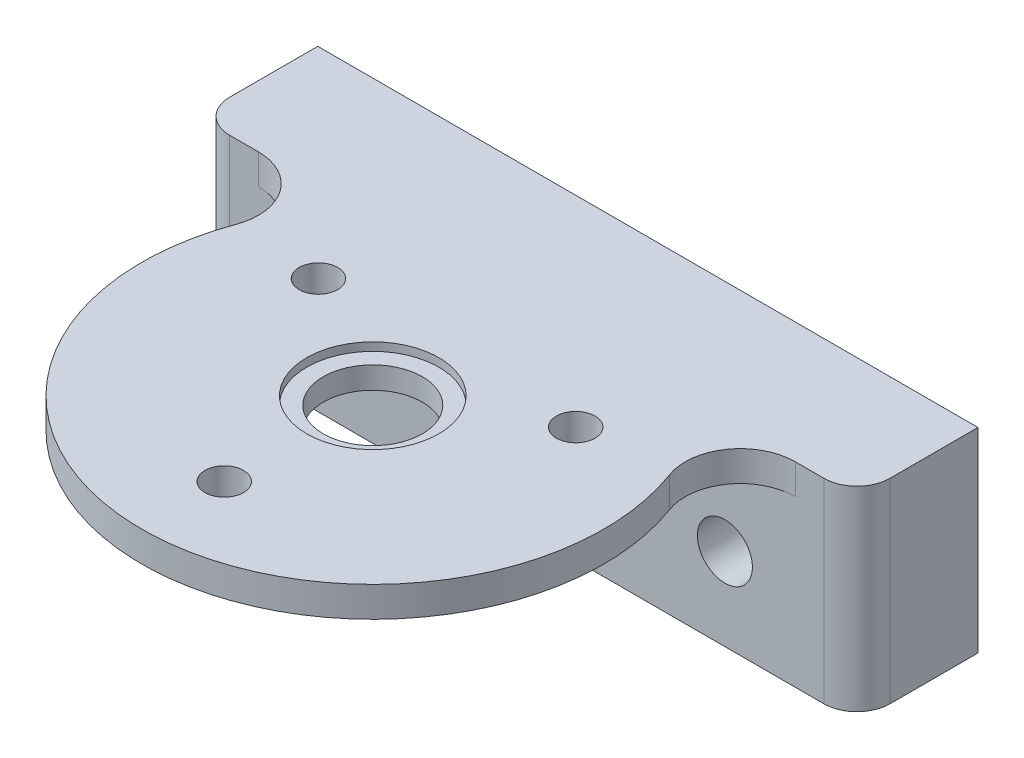
ISO-10303-21;
HEADER;
FILE_DESCRIPTION(('STEP AP214'),'2;1');
FILE_NAME('part.step','',(''),(''),'','','');
FILE_SCHEMA(('AUTOMOTIVE_DESIGN { 1 0 10303 214 1 1 1 1 }'));
ENDSEC;
DATA;
#1=APPLICATION_CONTEXT('core data for automotive mechanical design processes');
#2=APPLICATION_PROTOCOL_DEFINITION('international standard','automotive_design',2000,#1);
#3=PRODUCT_CONTEXT('',#1,'mechanical');
#4=PRODUCT('Part','Part','',(#3));
#5=PRODUCT_RELATED_PRODUCT_CATEGORY('part','',(#4));
#6=PRODUCT_DEFINITION_FORMATION('','',#4);
#7=PRODUCT_DEFINITION_CONTEXT('part definition',#1,'design');
#8=PRODUCT_DEFINITION('design','',#6,#7);
#9=PRODUCT_DEFINITION_SHAPE('','',#8);
#10=(LENGTH_UNIT() NAMED_UNIT(*) SI_UNIT(.MILLI.,.METRE.));
#11=(NAMED_UNIT(*) PLANE_ANGLE_UNIT() SI_UNIT($,.RADIAN.));
#12=(NAMED_UNIT(*) SI_UNIT($,.STERADIAN.) SOLID_ANGLE_UNIT());
#13=UNCERTAINTY_MEASURE_WITH_UNIT(LENGTH_MEASURE(1.E-05),#10,'distance_accuracy_value','');
#14=(GEOMETRIC_REPRESENTATION_CONTEXT(3) GLOBAL_UNCERTAINTY_ASSIGNED_CONTEXT((#13)) GLOBAL_UNIT_ASSIGNED_CONTEXT((#10,
#11,#12)) REPRESENTATION_CONTEXT('',''));
#15=CARTESIAN_POINT('',(0.,0.,0.));
#16=DIRECTION('',(0.,0.,1.));
#17=DIRECTION('',(1.,0.,0.));
#18=AXIS2_PLACEMENT_3D('',#15,#16,#17);
#19=CARTESIAN_POINT('',(0.,2.,0.));
#20=DIRECTION('',(0.,-1.,0.));
#21=DIRECTION('',(0.,0.,-1.));
#22=AXIS2_PLACEMENT_3D('',#19,#20,#21);
#23=CYLINDRICAL_SURFACE('',#22,4.5);
#24=CARTESIAN_POINT('',(0.,2.,0.));
#25=DIRECTION('',(0.,1.,0.));
#26=DIRECTION('',(0.,0.,1.));
#27=AXIS2_PLACEMENT_3D('',#24,#25,#26);
#28=CIRCLE('',#27,4.5);
#29=CARTESIAN_POINT('',(0.,2.,4.5));
#30=VERTEX_POINT('',#29);
#31=EDGE_CURVE('E180',#30,#30,#28,.T.);
#32=ORIENTED_EDGE('',*,*,#31,.T.);
#33=EDGE_LOOP('',(#32));
#34=FACE_BOUND('',#33,.T.);
#35=CARTESIAN_POINT('',(0.,0.,0.));
#36=DIRECTION('',(0.,1.,0.));
#37=DIRECTION('',(0.,0.,1.));
#38=AXIS2_PLACEMENT_3D('',#35,#36,#37);
#39=CIRCLE('',#38,4.5);
#40=CARTESIAN_POINT('',(0.,0.,4.5));
#41=VERTEX_POINT('',#40);
#42=EDGE_CURVE('E179',#41,#41,#39,.T.);
#43=ORIENTED_EDGE('',*,*,#42,.F.);
#44=EDGE_LOOP('',(#43));
#45=FACE_BOUND('',#44,.T.);
#46=ADVANCED_FACE('F36',(#34,#45),#23,.F.);
#47=CARTESIAN_POINT('',(0.,2.,0.));
#48=DIRECTION('',(0.,1.,0.));
#49=DIRECTION('',(0.,0.,1.));
#50=AXIS2_PLACEMENT_3D('',#47,#48,#49);
#51=PLANE('',#50);
#52=ORIENTED_EDGE('',*,*,#31,.F.);
#53=EDGE_LOOP('',(#52));
#54=FACE_BOUND('',#53,.T.);
#55=CARTESIAN_POINT('',(0.,2.,0.));
#56=DIRECTION('',(0.,1.,0.));
#57=DIRECTION('',(0.,0.,1.));
#58=AXIS2_PLACEMENT_3D('',#55,#56,#57);
#59=CIRCLE('',#58,6.);
#60=CARTESIAN_POINT('',(0.,2.,6.));
#61=VERTEX_POINT('',#60);
#62=EDGE_CURVE('E174',#61,#61,#59,.F.);
#63=ORIENTED_EDGE('',*,*,#62,.F.);
#64=EDGE_LOOP('',(#63));
#65=FACE_BOUND('',#64,.T.);
#66=ADVANCED_FACE('F272',(#54,#65),#51,.T.);
#67=CARTESIAN_POINT('',(0.,0.,0.));
#68=DIRECTION('',(0.,1.,0.));
#69=DIRECTION('',(0.,0.,1.));
#70=AXIS2_PLACEMENT_3D('',#67,#68,#69);
#71=PLANE('',#70);
#72=CARTESIAN_POINT('',(-11.6913429510899,0.,-6.75000000000005));
#73=DIRECTION('',(0.,1.,0.));
#74=DIRECTION('',(0.,0.,1.));
#75=AXIS2_PLACEMENT_3D('',#72,#73,#74);
#76=CIRCLE('',#75,1.75);
#77=CARTESIAN_POINT('',(-11.6913429510899,0.,-5.00000000000005));
#78=VERTEX_POINT('',#77);
#79=EDGE_CURVE('E158',#78,#78,#76,.T.);
#80=ORIENTED_EDGE('',*,*,#79,.T.);
#81=EDGE_LOOP('',(#80));
#82=FACE_BOUND('',#81,.T.);
#83=CARTESIAN_POINT('',(11.69134295109,0.,-6.74999999999989));
#84=DIRECTION('',(0.,1.,0.));
#85=DIRECTION('',(0.,0.,1.));
#86=AXIS2_PLACEMENT_3D('',#83,#84,#85);
#87=CIRCLE('',#86,1.75);
#88=CARTESIAN_POINT('',(11.69134295109,0.,-4.99999999999989));
#89=VERTEX_POINT('',#88);
#90=EDGE_CURVE('E153',#89,#89,#87,.T.);
#91=ORIENTED_EDGE('',*,*,#90,.T.);
#92=EDGE_LOOP('',(#91));
#93=FACE_BOUND('',#92,.T.);
#94=CARTESIAN_POINT('',(0.,0.,13.5));
#95=DIRECTION('',(0.,1.,0.));
#96=DIRECTION('',(0.,0.,1.));
#97=AXIS2_PLACEMENT_3D('',#94,#95,#96);
#98=CIRCLE('',#97,1.75);
#99=CARTESIAN_POINT('',(0.,0.,15.25));
#100=VERTEX_POINT('',#99);
#101=EDGE_CURVE('E164',#100,#100,#98,.T.);
#102=ORIENTED_EDGE('',*,*,#101,.T.);
#103=EDGE_LOOP('',(#102));
#104=FACE_BOUND('',#103,.T.);
#105=ORIENTED_EDGE('',*,*,#42,.T.);
#106=EDGE_LOOP('',(#105));
#107=FACE_BOUND('',#106,.T.);
#108=CARTESIAN_POINT('',(0.,0.,0.));
#109=DIRECTION('',(0.,1.,0.));
#110=DIRECTION('',(0.,0.,1.));
#111=AXIS2_PLACEMENT_3D('',#108,#109,#110);
#112=CIRCLE('',#111,21.);
#113=CARTESIAN_POINT('',(-19.70173302082,0.,-7.26923076923077));
#114=VERTEX_POINT('',#113);
#115=CARTESIAN_POINT('',(19.70173302082,0.,-7.26923076923077));
#116=VERTEX_POINT('',#115);
#117=EDGE_CURVE('E168',#114,#116,#112,.T.);
#118=ORIENTED_EDGE('',*,*,#117,.F.);
#119=CARTESIAN_POINT('',(-24.3926218353009,0.,-9.));
#120=DIRECTION('',(0.,1.,0.));
#121=DIRECTION('',(0.,0.,1.));
#122=AXIS2_PLACEMENT_3D('',#119,#120,#121);
#123=CIRCLE('',#122,5.);
#124=CARTESIAN_POINT('',(-24.3926218353009,0.,-14.));
#125=VERTEX_POINT('',#124);
#126=EDGE_CURVE('E44',#114,#125,#123,.T.);
#127=ORIENTED_EDGE('',*,*,#126,.T.);
#128=DIRECTION('',(1.,0.,0.));
#129=VECTOR('',#128,1.);
#130=CARTESIAN_POINT('',(0.,0.,-14.));
#131=LINE('',#130,#129);
#132=CARTESIAN_POINT('',(24.3926218353009,0.,-14.));
#133=VERTEX_POINT('',#132);
#134=EDGE_CURVE('E51',#125,#133,#131,.T.);
#135=ORIENTED_EDGE('',*,*,#134,.T.);
#136=CARTESIAN_POINT('',(24.3926218353009,0.,-8.99999999999999));
#137=DIRECTION('',(0.,1.,0.));
#138=DIRECTION('',(0.,0.,1.));
#139=AXIS2_PLACEMENT_3D('',#136,#137,#138);
#140=CIRCLE('',#139,5.);
#141=EDGE_CURVE('E215',#133,#116,#140,.T.);
#142=ORIENTED_EDGE('',*,*,#141,.T.);
#143=EDGE_LOOP('',(#118,#127,#135,#142));
#144=FACE_BOUND('',#143,.T.);
#145=ADVANCED_FACE('F218',(#82,#93,#104,#107,#144),#71,.F.);
#146=CARTESIAN_POINT('',(0.,62.89696961967,0.));
#147=DIRECTION('',(0.,-1.,0.));
#148=DIRECTION('',(0.,0.,-1.));
#149=AXIS2_PLACEMENT_3D('',#146,#147,#148);
#150=CYLINDRICAL_SURFACE('',#149,6.);
#151=ORIENTED_EDGE('',*,*,#62,.T.);
#152=EDGE_LOOP('',(#151));
#153=FACE_BOUND('',#152,.T.);
#154=CARTESIAN_POINT('',(0.,2.75,0.));
#155=DIRECTION('',(0.,1.,0.));
#156=DIRECTION('',(0.,0.,1.));
#157=AXIS2_PLACEMENT_3D('',#154,#155,#156);
#158=CIRCLE('',#157,6.);
#159=CARTESIAN_POINT('',(0.,2.75,6.));
#160=VERTEX_POINT('',#159);
#161=EDGE_CURVE('E167',#160,#160,#158,.T.);
#162=ORIENTED_EDGE('',*,*,#161,.T.);
#163=EDGE_LOOP('',(#162));
#164=FACE_BOUND('',#163,.T.);
#165=ADVANCED_FACE('F324',(#153,#164),#150,.F.);
#166=CARTESIAN_POINT('',(0.,62.89696961967,0.));
#167=DIRECTION('',(0.,-1.,0.));
#168=DIRECTION('',(0.,0.,-1.));
#169=AXIS2_PLACEMENT_3D('',#166,#167,#168);
#170=CYLINDRICAL_SURFACE('',#169,21.);
#171=ORIENTED_EDGE('',*,*,#117,.T.);
#172=DIRECTION('',(0.,-1.,0.));
#173=VECTOR('',#172,1.);
#174=CARTESIAN_POINT('',(19.70173302082,62.89696961967,-7.26923076923077));
#175=LINE('',#174,#173);
#176=CARTESIAN_POINT('',(19.70173302082,2.75,-7.26923076923077));
#177=VERTEX_POINT('',#176);
#178=EDGE_CURVE('E206',#116,#177,#175,.F.);
#179=ORIENTED_EDGE('',*,*,#178,.T.);
#180=CARTESIAN_POINT('',(0.,2.75,0.));
#181=DIRECTION('',(0.,1.,0.));
#182=DIRECTION('',(0.,0.,1.));
#183=AXIS2_PLACEMENT_3D('',#180,#181,#182);
#184=CIRCLE('',#183,21.);
#185=CARTESIAN_POINT('',(-19.70173302082,2.75,-7.26923076923077));
#186=VERTEX_POINT('',#185);
#187=EDGE_CURVE('E171',#186,#177,#184,.T.);
#188=ORIENTED_EDGE('',*,*,#187,.F.);
#189=DIRECTION('',(0.,-1.,0.));
#190=VECTOR('',#189,1.);
#191=CARTESIAN_POINT('',(-19.70173302082,62.89696961967,-7.26923076923077));
#192=LINE('',#191,#190);
#193=EDGE_CURVE('E203',#186,#114,#192,.T.);
#194=ORIENTED_EDGE('',*,*,#193,.T.);
#195=EDGE_LOOP('',(#171,#179,#188,#194));
#196=FACE_BOUND('',#195,.T.);
#197=ADVANCED_FACE('F298',(#196),#170,.T.);
#198=CARTESIAN_POINT('',(0.,2.75,0.));
#199=DIRECTION('',(0.,1.,0.));
#200=DIRECTION('',(0.,0.,1.));
#201=AXIS2_PLACEMENT_3D('',#198,#199,#200);
#202=PLANE('',#201);
#203=DIRECTION('',(0.,0.,-1.));
#204=VECTOR('',#203,1.);
#205=CARTESIAN_POINT('',(-30.,2.75,-25.));
#206=LINE('',#205,#204);
#207=CARTESIAN_POINT('',(-30.,2.75,-17.));
#208=VERTEX_POINT('',#207);
#209=CARTESIAN_POINT('',(-30.,2.75,-25.));
#210=VERTEX_POINT('',#209);
#211=EDGE_CURVE('E126',#208,#210,#206,.T.);
#212=ORIENTED_EDGE('',*,*,#211,.F.);
#213=CARTESIAN_POINT('',(-27.,2.75,-17.));
#214=DIRECTION('',(0.,1.,0.));
#215=DIRECTION('',(0.,0.,1.));
#216=AXIS2_PLACEMENT_3D('',#213,#214,#215);
#217=CIRCLE('',#216,3.);
#218=CARTESIAN_POINT('',(-27.,2.75,-14.));
#219=VERTEX_POINT('',#218);
#220=EDGE_CURVE('E197',#208,#219,#217,.T.);
#221=ORIENTED_EDGE('',*,*,#220,.T.);
#222=DIRECTION('',(-1.,0.,0.));
#223=VECTOR('',#222,1.);
#224=CARTESIAN_POINT('',(-30.,2.75,-14.));
#225=LINE('',#224,#223);
#226=CARTESIAN_POINT('',(-24.3926218353009,2.75,-14.));
#227=VERTEX_POINT('',#226);
#228=EDGE_CURVE('E135',#227,#219,#225,.T.);
#229=ORIENTED_EDGE('',*,*,#228,.F.);
#230=CARTESIAN_POINT('',(-24.3926218353009,2.75,-9.));
#231=DIRECTION('',(0.,1.,0.));
#232=DIRECTION('',(0.,0.,1.));
#233=AXIS2_PLACEMENT_3D('',#230,#231,#232);
#234=CIRCLE('',#233,5.);
#235=EDGE_CURVE('E12',#227,#186,#234,.F.);
#236=ORIENTED_EDGE('',*,*,#235,.T.);
#237=ORIENTED_EDGE('',*,*,#187,.T.);
#238=CARTESIAN_POINT('',(24.3926218353009,2.75,-8.99999999999999));
#239=DIRECTION('',(0.,1.,0.));
#240=DIRECTION('',(0.,0.,1.));
#241=AXIS2_PLACEMENT_3D('',#238,#239,#240);
#242=CIRCLE('',#241,5.);
#243=CARTESIAN_POINT('',(24.3926218353009,2.75,-14.));
#244=VERTEX_POINT('',#243);
#245=EDGE_CURVE('E213',#177,#244,#242,.F.);
#246=ORIENTED_EDGE('',*,*,#245,.T.);
#247=CARTESIAN_POINT('',(27.,2.75,-14.));
#248=VERTEX_POINT('',#247);
#249=EDGE_CURVE('E137',#248,#244,#225,.T.);
#250=ORIENTED_EDGE('',*,*,#249,.F.);
#251=CARTESIAN_POINT('',(27.,2.75,-17.));
#252=DIRECTION('',(0.,1.,0.));
#253=DIRECTION('',(0.,0.,1.));
#254=AXIS2_PLACEMENT_3D('',#251,#252,#253);
#255=CIRCLE('',#254,3.);
#256=CARTESIAN_POINT('',(30.,2.75,-17.));
#257=VERTEX_POINT('',#256);
#258=EDGE_CURVE('E195',#248,#257,#255,.T.);
#259=ORIENTED_EDGE('',*,*,#258,.T.);
#260=DIRECTION('',(0.,0.,1.));
#261=VECTOR('',#260,1.);
#262=CARTESIAN_POINT('',(30.,2.75,-25.));
#263=LINE('',#262,#261);
#264=CARTESIAN_POINT('',(30.,2.75,-25.));
#265=VERTEX_POINT('',#264);
#266=EDGE_CURVE('E142',#265,#257,#263,.T.);
#267=ORIENTED_EDGE('',*,*,#266,.F.);
#268=DIRECTION('',(1.,0.,0.));
#269=VECTOR('',#268,1.);
#270=CARTESIAN_POINT('',(-30.,2.75,-25.));
#271=LINE('',#270,#269);
#272=EDGE_CURVE('E130',#210,#265,#271,.T.);
#273=ORIENTED_EDGE('',*,*,#272,.F.);
#274=EDGE_LOOP('',(#212,#221,#229,#236,#237,#246,#250,#259,#267,#273));
#275=FACE_BOUND('',#274,.T.);
#276=CARTESIAN_POINT('',(-11.6913429510899,2.75,-6.75000000000005));
#277=DIRECTION('',(0.,1.,0.));
#278=DIRECTION('',(-0.866025403784436,0.,-0.500000000000004));
#279=AXIS2_PLACEMENT_3D('',#276,#277,#278);
#280=CIRCLE('',#279,1.75);
#281=CARTESIAN_POINT('',(-13.2068874077127,2.75,-7.62500000000006));
#282=VERTEX_POINT('',#281);
#283=EDGE_CURVE('E150',#282,#282,#280,.T.);
#284=ORIENTED_EDGE('',*,*,#283,.F.);
#285=EDGE_LOOP('',(#284));
#286=FACE_BOUND('',#285,.T.);
#287=CARTESIAN_POINT('',(11.69134295109,2.75,-6.74999999999989));
#288=DIRECTION('',(0.,1.,0.));
#289=DIRECTION('',(0.866025403784443,0.,-0.499999999999992));
#290=AXIS2_PLACEMENT_3D('',#287,#288,#289);
#291=CIRCLE('',#290,1.75);
#292=CARTESIAN_POINT('',(13.2068874077128,2.75,-7.62499999999988));
#293=VERTEX_POINT('',#292);
#294=EDGE_CURVE('E149',#293,#293,#291,.T.);
#295=ORIENTED_EDGE('',*,*,#294,.F.);
#296=EDGE_LOOP('',(#295));
#297=FACE_BOUND('',#296,.T.);
#298=CARTESIAN_POINT('',(0.,2.75,13.5));
#299=DIRECTION('',(0.,1.,0.));
#300=DIRECTION('',(0.,0.,1.));
#301=AXIS2_PLACEMENT_3D('',#298,#299,#300);
#302=CIRCLE('',#301,1.75);
#303=CARTESIAN_POINT('',(0.,2.75,15.25));
#304=VERTEX_POINT('',#303);
#305=EDGE_CURVE('E161',#304,#304,#302,.T.);
#306=ORIENTED_EDGE('',*,*,#305,.F.);
#307=EDGE_LOOP('',(#306));
#308=FACE_BOUND('',#307,.T.);
#309=ORIENTED_EDGE('',*,*,#161,.F.);
#310=EDGE_LOOP('',(#309));
#311=FACE_BOUND('',#310,.T.);
#312=ADVANCED_FACE('F225',(#275,#286,#297,#308,#311),#202,.T.);
#313=CARTESIAN_POINT('',(0.,-1.75,13.5));
#314=DIRECTION('',(0.,1.,0.));
#315=DIRECTION('',(0.,0.,1.));
#316=AXIS2_PLACEMENT_3D('',#313,#314,#315);
#317=CYLINDRICAL_SURFACE('',#316,1.75);
#318=ORIENTED_EDGE('',*,*,#305,.T.);
#319=EDGE_LOOP('',(#318));
#320=FACE_BOUND('',#319,.T.);
#321=ORIENTED_EDGE('',*,*,#101,.F.);
#322=EDGE_LOOP('',(#321));
#323=FACE_BOUND('',#322,.T.);
#324=ADVANCED_FACE('F319',(#320,#323),#317,.F.);
#325=CARTESIAN_POINT('',(11.69134295109,-1.75,-6.74999999999989));
#326=DIRECTION('',(0.,1.,0.));
#327=DIRECTION('',(0.,0.,1.));
#328=AXIS2_PLACEMENT_3D('',#325,#326,#327);
#329=CYLINDRICAL_SURFACE('',#328,1.75);
#330=ORIENTED_EDGE('',*,*,#294,.T.);
#331=EDGE_LOOP('',(#330));
#332=FACE_BOUND('',#331,.T.);
#333=ORIENTED_EDGE('',*,*,#90,.F.);
#334=EDGE_LOOP('',(#333));
#335=FACE_BOUND('',#334,.T.);
#336=ADVANCED_FACE('F315',(#332,#335),#329,.F.);
#337=CARTESIAN_POINT('',(-11.6913429510899,-1.75,-6.75000000000005));
#338=DIRECTION('',(0.,1.,0.));
#339=DIRECTION('',(0.,0.,1.));
#340=AXIS2_PLACEMENT_3D('',#337,#338,#339);
#341=CYLINDRICAL_SURFACE('',#340,1.75);
#342=ORIENTED_EDGE('',*,*,#283,.T.);
#343=EDGE_LOOP('',(#342));
#344=FACE_BOUND('',#343,.T.);
#345=ORIENTED_EDGE('',*,*,#79,.F.);
#346=EDGE_LOOP('',(#345));
#347=FACE_BOUND('',#346,.T.);
#348=ADVANCED_FACE('F254',(#344,#347),#341,.F.);
#349=CARTESIAN_POINT('',(-30.,63.75,-14.));
#350=DIRECTION('',(0.,0.,1.));
#351=DIRECTION('',(1.,0.,0.));
#352=AXIS2_PLACEMENT_3D('',#349,#350,#351);
#353=PLANE('',#352);
#354=CARTESIAN_POINT('',(-18.,-7.5,-14.));
#355=DIRECTION('',(0.,0.,1.));
#356=DIRECTION('',(1.,0.,0.));
#357=AXIS2_PLACEMENT_3D('',#354,#355,#356);
#358=CIRCLE('',#357,2.5);
#359=CARTESIAN_POINT('',(-15.5,-7.5,-14.));
#360=VERTEX_POINT('',#359);
#361=EDGE_CURVE('E235',#360,#360,#358,.T.);
#362=ORIENTED_EDGE('',*,*,#361,.F.);
#363=EDGE_LOOP('',(#362));
#364=FACE_BOUND('',#363,.T.);
#365=CARTESIAN_POINT('',(18.,-7.49999999999999,-14.));
#366=DIRECTION('',(0.,0.,1.));
#367=DIRECTION('',(-1.,0.,0.));
#368=AXIS2_PLACEMENT_3D('',#365,#366,#367);
#369=CIRCLE('',#368,2.5);
#370=CARTESIAN_POINT('',(15.5,-7.49999999999999,-14.));
#371=VERTEX_POINT('',#370);
#372=EDGE_CURVE('E241',#371,#371,#369,.T.);
#373=ORIENTED_EDGE('',*,*,#372,.F.);
#374=EDGE_LOOP('',(#373));
#375=FACE_BOUND('',#374,.T.);
#376=ORIENTED_EDGE('',*,*,#249,.T.);
#377=DIRECTION('',(0.,-1.,0.));
#378=VECTOR('',#377,1.);
#379=CARTESIAN_POINT('',(24.3926218353009,63.75,-14.));
#380=LINE('',#379,#378);
#381=EDGE_CURVE('E211',#244,#133,#380,.T.);
#382=ORIENTED_EDGE('',*,*,#381,.T.);
#383=ORIENTED_EDGE('',*,*,#134,.F.);
#384=DIRECTION('',(0.,-1.,0.));
#385=VECTOR('',#384,1.);
#386=CARTESIAN_POINT('',(-24.3926218353009,63.75,-14.));
#387=LINE('',#386,#385);
#388=EDGE_CURVE('E209',#125,#227,#387,.F.);
#389=ORIENTED_EDGE('',*,*,#388,.T.);
#390=ORIENTED_EDGE('',*,*,#228,.T.);
#391=DIRECTION('',(0.,-1.,0.));
#392=VECTOR('',#391,1.);
#393=CARTESIAN_POINT('',(-27.,63.75,-14.));
#394=LINE('',#393,#392);
#395=CARTESIAN_POINT('',(-27.,-15.,-14.));
#396=VERTEX_POINT('',#395);
#397=EDGE_CURVE('E187',#219,#396,#394,.T.);
#398=ORIENTED_EDGE('',*,*,#397,.T.);
#399=DIRECTION('',(-1.,0.,0.));
#400=VECTOR('',#399,1.);
#401=CARTESIAN_POINT('',(-30.,-15.,-14.));
#402=LINE('',#401,#400);
#403=CARTESIAN_POINT('',(27.,-15.,-14.));
#404=VERTEX_POINT('',#403);
#405=EDGE_CURVE('E120',#404,#396,#402,.T.);
#406=ORIENTED_EDGE('',*,*,#405,.F.);
#407=DIRECTION('',(0.,-1.,0.));
#408=VECTOR('',#407,1.);
#409=CARTESIAN_POINT('',(27.,63.75,-14.));
#410=LINE('',#409,#408);
#411=EDGE_CURVE('E183',#404,#248,#410,.F.);
#412=ORIENTED_EDGE('',*,*,#411,.T.);
#413=EDGE_LOOP('',(#376,#382,#383,#389,#390,#398,#406,#412));
#414=FACE_BOUND('',#413,.T.);
#415=ADVANCED_FACE('F223',(#364,#375,#414),#353,.T.);
#416=CARTESIAN_POINT('',(-30.,63.75,-25.));
#417=DIRECTION('',(-1.,0.,0.));
#418=DIRECTION('',(0.,0.,1.));
#419=AXIS2_PLACEMENT_3D('',#416,#417,#418);
#420=PLANE('',#419);
#421=DIRECTION('',(0.,0.,-1.));
#422=VECTOR('',#421,1.);
#423=CARTESIAN_POINT('',(-30.,-15.,-25.));
#424=LINE('',#423,#422);
#425=CARTESIAN_POINT('',(-30.,-15.,-17.));
#426=VERTEX_POINT('',#425);
#427=CARTESIAN_POINT('',(-30.,-15.,-25.));
#428=VERTEX_POINT('',#427);
#429=EDGE_CURVE('E109',#426,#428,#424,.T.);
#430=ORIENTED_EDGE('',*,*,#429,.F.);
#431=DIRECTION('',(0.,-1.,0.));
#432=VECTOR('',#431,1.);
#433=CARTESIAN_POINT('',(-30.,63.75,-17.));
#434=LINE('',#433,#432);
#435=EDGE_CURVE('E193',#426,#208,#434,.F.);
#436=ORIENTED_EDGE('',*,*,#435,.T.);
#437=ORIENTED_EDGE('',*,*,#211,.T.);
#438=DIRECTION('',(0.,-1.,0.));
#439=VECTOR('',#438,1.);
#440=CARTESIAN_POINT('',(-30.,63.75,-25.));
#441=LINE('',#440,#439);
#442=EDGE_CURVE('E123',#210,#428,#441,.T.);
#443=ORIENTED_EDGE('',*,*,#442,.T.);
#444=EDGE_LOOP('',(#430,#436,#437,#443));
#445=FACE_BOUND('',#444,.T.);
#446=ADVANCED_FACE('F124',(#445),#420,.T.);
#447=CARTESIAN_POINT('',(-30.,63.75,-25.));
#448=DIRECTION('',(0.,0.,-1.));
#449=DIRECTION('',(-1.,0.,0.));
#450=AXIS2_PLACEMENT_3D('',#447,#448,#449);
#451=PLANE('',#450);
#452=CARTESIAN_POINT('',(-18.,-7.5,-25.));
#453=DIRECTION('',(0.,0.,-1.));
#454=DIRECTION('',(-1.,0.,0.));
#455=AXIS2_PLACEMENT_3D('',#452,#453,#454);
#456=CIRCLE('',#455,2.5);
#457=CARTESIAN_POINT('',(-20.5,-7.5,-25.));
#458=VERTEX_POINT('',#457);
#459=EDGE_CURVE('E244',#458,#458,#456,.F.);
#460=ORIENTED_EDGE('',*,*,#459,.T.);
#461=EDGE_LOOP('',(#460));
#462=FACE_BOUND('',#461,.T.);
#463=CARTESIAN_POINT('',(18.,-7.49999999999999,-25.));
#464=DIRECTION('',(0.,0.,-1.));
#465=DIRECTION('',(-1.,0.,0.));
#466=AXIS2_PLACEMENT_3D('',#463,#464,#465);
#467=CIRCLE('',#466,2.5);
#468=CARTESIAN_POINT('',(15.5,-7.49999999999999,-25.));
#469=VERTEX_POINT('',#468);
#470=EDGE_CURVE('E238',#469,#469,#467,.F.);
#471=ORIENTED_EDGE('',*,*,#470,.T.);
#472=EDGE_LOOP('',(#471));
#473=FACE_BOUND('',#472,.T.);
#474=ORIENTED_EDGE('',*,*,#442,.F.);
#475=ORIENTED_EDGE('',*,*,#272,.T.);
#476=DIRECTION('',(0.,-1.,0.));
#477=VECTOR('',#476,1.);
#478=CARTESIAN_POINT('',(30.,63.75,-25.));
#479=LINE('',#478,#477);
#480=CARTESIAN_POINT('',(30.,-15.,-25.));
#481=VERTEX_POINT('',#480);
#482=EDGE_CURVE('E134',#265,#481,#479,.T.);
#483=ORIENTED_EDGE('',*,*,#482,.T.);
#484=DIRECTION('',(1.,0.,0.));
#485=VECTOR('',#484,1.);
#486=CARTESIAN_POINT('',(-30.,-15.,-25.));
#487=LINE('',#486,#485);
#488=EDGE_CURVE('E115',#428,#481,#487,.T.);
#489=ORIENTED_EDGE('',*,*,#488,.F.);
#490=EDGE_LOOP('',(#474,#475,#483,#489));
#491=FACE_BOUND('',#490,.T.);
#492=ADVANCED_FACE('F132',(#462,#473,#491),#451,.T.);
#493=CARTESIAN_POINT('',(30.,63.75,-25.));
#494=DIRECTION('',(1.,0.,0.));
#495=DIRECTION('',(0.,0.,-1.));
#496=AXIS2_PLACEMENT_3D('',#493,#494,#495);
#497=PLANE('',#496);
#498=ORIENTED_EDGE('',*,*,#266,.T.);
#499=DIRECTION('',(0.,-1.,0.));
#500=VECTOR('',#499,1.);
#501=CARTESIAN_POINT('',(30.,63.75,-17.));
#502=LINE('',#501,#500);
#503=CARTESIAN_POINT('',(30.,-15.,-17.));
#504=VERTEX_POINT('',#503);
#505=EDGE_CURVE('E200',#257,#504,#502,.T.);
#506=ORIENTED_EDGE('',*,*,#505,.T.);
#507=DIRECTION('',(0.,0.,1.));
#508=VECTOR('',#507,1.);
#509=CARTESIAN_POINT('',(30.,-15.,-25.));
#510=LINE('',#509,#508);
#511=EDGE_CURVE('E234',#481,#504,#510,.T.);
#512=ORIENTED_EDGE('',*,*,#511,.F.);
#513=ORIENTED_EDGE('',*,*,#482,.F.);
#514=EDGE_LOOP('',(#498,#506,#512,#513));
#515=FACE_BOUND('',#514,.T.);
#516=ADVANCED_FACE('F268',(#515),#497,.T.);
#517=CARTESIAN_POINT('',(0.,-15.,0.));
#518=DIRECTION('',(0.,1.,0.));
#519=DIRECTION('',(0.,0.,1.));
#520=AXIS2_PLACEMENT_3D('',#517,#518,#519);
#521=PLANE('',#520);
#522=ORIENTED_EDGE('',*,*,#405,.T.);
#523=CARTESIAN_POINT('',(-27.,-15.,-17.));
#524=DIRECTION('',(0.,1.,0.));
#525=DIRECTION('',(0.,0.,1.));
#526=AXIS2_PLACEMENT_3D('',#523,#524,#525);
#527=CIRCLE('',#526,3.);
#528=EDGE_CURVE('E117',#396,#426,#527,.F.);
#529=ORIENTED_EDGE('',*,*,#528,.T.);
#530=ORIENTED_EDGE('',*,*,#429,.T.);
#531=ORIENTED_EDGE('',*,*,#488,.T.);
#532=ORIENTED_EDGE('',*,*,#511,.T.);
#533=CARTESIAN_POINT('',(27.,-15.,-17.));
#534=DIRECTION('',(0.,1.,0.));
#535=DIRECTION('',(0.,0.,1.));
#536=AXIS2_PLACEMENT_3D('',#533,#534,#535);
#537=CIRCLE('',#536,3.);
#538=EDGE_CURVE('E190',#504,#404,#537,.F.);
#539=ORIENTED_EDGE('',*,*,#538,.T.);
#540=EDGE_LOOP('',(#522,#529,#530,#531,#532,#539));
#541=FACE_BOUND('',#540,.T.);
#542=ADVANCED_FACE('F112',(#541),#521,.F.);
#543=CARTESIAN_POINT('',(18.,-7.49999999999999,-25.001));
#544=DIRECTION('',(0.,0.,1.));
#545=DIRECTION('',(1.,0.,0.));
#546=AXIS2_PLACEMENT_3D('',#543,#544,#545);
#547=CYLINDRICAL_SURFACE('',#546,2.5);
#548=ORIENTED_EDGE('',*,*,#470,.F.);
#549=EDGE_LOOP('',(#548));
#550=FACE_BOUND('',#549,.T.);
#551=ORIENTED_EDGE('',*,*,#372,.T.);
#552=EDGE_LOOP('',(#551));
#553=FACE_BOUND('',#552,.T.);
#554=ADVANCED_FACE('F258',(#550,#553),#547,.F.);
#555=CARTESIAN_POINT('',(-18.,-7.5,-25.001));
#556=DIRECTION('',(0.,0.,1.));
#557=DIRECTION('',(1.,0.,0.));
#558=AXIS2_PLACEMENT_3D('',#555,#556,#557);
#559=CYLINDRICAL_SURFACE('',#558,2.5);
#560=ORIENTED_EDGE('',*,*,#459,.F.);
#561=EDGE_LOOP('',(#560));
#562=FACE_BOUND('',#561,.T.);
#563=ORIENTED_EDGE('',*,*,#361,.T.);
#564=EDGE_LOOP('',(#563));
#565=FACE_BOUND('',#564,.T.);
#566=ADVANCED_FACE('F250',(#562,#565),#559,.F.);
#567=CARTESIAN_POINT('',(-27.,63.75,-17.));
#568=DIRECTION('',(0.,-1.,0.));
#569=DIRECTION('',(0.,0.,-1.));
#570=AXIS2_PLACEMENT_3D('',#567,#568,#569);
#571=CYLINDRICAL_SURFACE('',#570,3.);
#572=ORIENTED_EDGE('',*,*,#220,.F.);
#573=ORIENTED_EDGE('',*,*,#435,.F.);
#574=ORIENTED_EDGE('',*,*,#528,.F.);
#575=ORIENTED_EDGE('',*,*,#397,.F.);
#576=EDGE_LOOP('',(#572,#573,#574,#575));
#577=FACE_BOUND('',#576,.T.);
#578=ADVANCED_FACE('F231',(#577),#571,.T.);
#579=CARTESIAN_POINT('',(27.,63.75,-17.));
#580=DIRECTION('',(0.,-1.,0.));
#581=DIRECTION('',(0.,0.,-1.));
#582=AXIS2_PLACEMENT_3D('',#579,#580,#581);
#583=CYLINDRICAL_SURFACE('',#582,3.);
#584=ORIENTED_EDGE('',*,*,#258,.F.);
#585=ORIENTED_EDGE('',*,*,#411,.F.);
#586=ORIENTED_EDGE('',*,*,#538,.F.);
#587=ORIENTED_EDGE('',*,*,#505,.F.);
#588=EDGE_LOOP('',(#584,#585,#586,#587));
#589=FACE_BOUND('',#588,.T.);
#590=ADVANCED_FACE('F285',(#589),#583,.T.);
#591=CARTESIAN_POINT('',(24.3926218353009,62.89696961967,-8.99999999999999));
#592=DIRECTION('',(0.,-1.,0.));
#593=DIRECTION('',(0.,0.,-1.));
#594=AXIS2_PLACEMENT_3D('',#591,#592,#593);
#595=CYLINDRICAL_SURFACE('',#594,5.);
#596=ORIENTED_EDGE('',*,*,#141,.F.);
#597=ORIENTED_EDGE('',*,*,#381,.F.);
#598=ORIENTED_EDGE('',*,*,#245,.F.);
#599=ORIENTED_EDGE('',*,*,#178,.F.);
#600=EDGE_LOOP('',(#596,#597,#598,#599));
#601=FACE_BOUND('',#600,.T.);
#602=ADVANCED_FACE('F287',(#601),#595,.F.);
#603=CARTESIAN_POINT('',(-24.3926218353009,62.89696961967,-9.));
#604=DIRECTION('',(0.,-1.,0.));
#605=DIRECTION('',(0.,0.,-1.));
#606=AXIS2_PLACEMENT_3D('',#603,#604,#605);
#607=CYLINDRICAL_SURFACE('',#606,5.);
#608=ORIENTED_EDGE('',*,*,#235,.F.);
#609=ORIENTED_EDGE('',*,*,#388,.F.);
#610=ORIENTED_EDGE('',*,*,#126,.F.);
#611=ORIENTED_EDGE('',*,*,#193,.F.);
#612=EDGE_LOOP('',(#608,#609,#610,#611));
#613=FACE_BOUND('',#612,.T.);
#614=ADVANCED_FACE('F38',(#613),#607,.F.);
#615=CLOSED_SHELL('',(#46,#66,#145,#165,#197,#312,#324,#336,#348,#415,#446,#492,#516,#542,#554,
#566,#578,#590,#602,#614));
#616=MANIFOLD_SOLID_BREP('B2',#615);
#617=ADVANCED_BREP_SHAPE_REPRESENTATION('',(#18,#616),#14);
#618=SHAPE_DEFINITION_REPRESENTATION(#9,#617);
ENDSEC;
END-ISO-10303-21;
